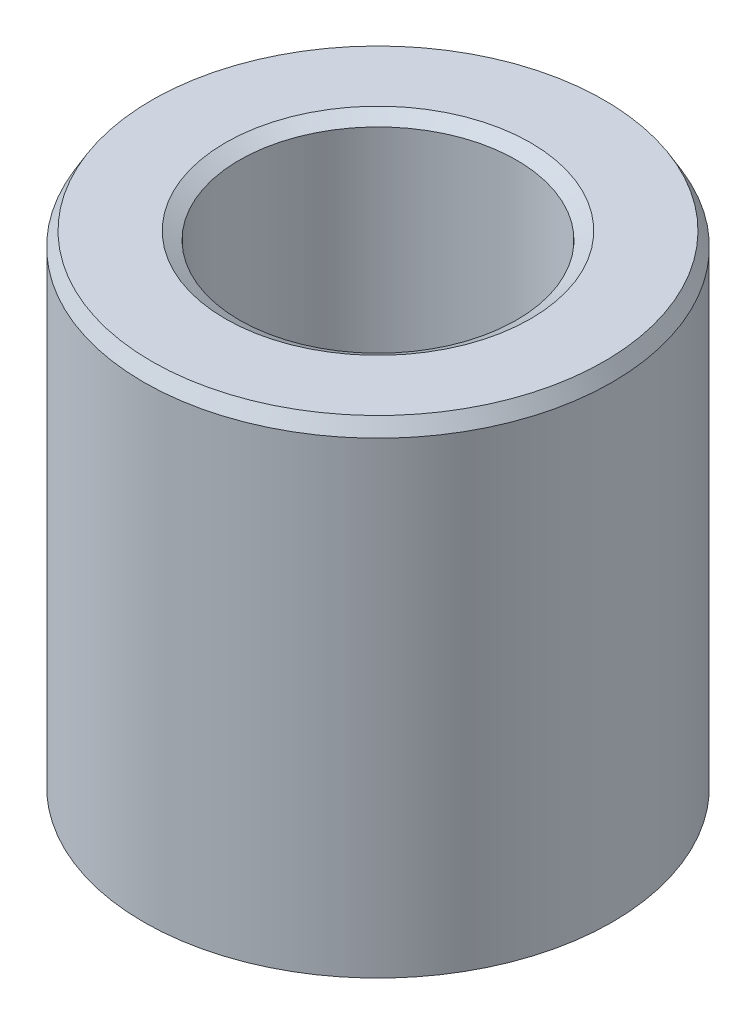
ISO-10303-21;
HEADER;
FILE_DESCRIPTION(('STEP AP214'),'2;1');
FILE_NAME('part.step','',(''),(''),'','','');
FILE_SCHEMA(('AUTOMOTIVE_DESIGN { 1 0 10303 214 1 1 1 1 }'));
ENDSEC;
DATA;
#1=APPLICATION_CONTEXT('core data for automotive mechanical design processes');
#2=APPLICATION_PROTOCOL_DEFINITION('international standard','automotive_design',2000,#1);
#3=PRODUCT_CONTEXT('',#1,'mechanical');
#4=PRODUCT('Part','Part','',(#3));
#5=PRODUCT_RELATED_PRODUCT_CATEGORY('part','',(#4));
#6=PRODUCT_DEFINITION_FORMATION('','',#4);
#7=PRODUCT_DEFINITION_CONTEXT('part definition',#1,'design');
#8=PRODUCT_DEFINITION('design','',#6,#7);
#9=PRODUCT_DEFINITION_SHAPE('','',#8);
#10=(LENGTH_UNIT() NAMED_UNIT(*) SI_UNIT(.MILLI.,.METRE.));
#11=(NAMED_UNIT(*) PLANE_ANGLE_UNIT() SI_UNIT($,.RADIAN.));
#12=(NAMED_UNIT(*) SI_UNIT($,.STERADIAN.) SOLID_ANGLE_UNIT());
#13=UNCERTAINTY_MEASURE_WITH_UNIT(LENGTH_MEASURE(1.E-05),#10,'distance_accuracy_value','');
#14=(GEOMETRIC_REPRESENTATION_CONTEXT(3) GLOBAL_UNCERTAINTY_ASSIGNED_CONTEXT((#13)) GLOBAL_UNIT_ASSIGNED_CONTEXT((#10,
#11,#12)) REPRESENTATION_CONTEXT('',''));
#15=CARTESIAN_POINT('',(0.,0.,0.));
#16=DIRECTION('',(0.,0.,1.));
#17=DIRECTION('',(1.,0.,0.));
#18=AXIS2_PLACEMENT_3D('',#15,#16,#17);
#19=CARTESIAN_POINT('',(0.,20.8910306341765,0.));
#20=DIRECTION('',(0.,-1.,0.));
#21=DIRECTION('',(0.,0.,-1.));
#22=AXIS2_PLACEMENT_3D('',#19,#20,#21);
#23=CYLINDRICAL_SURFACE('',#22,10.);
#24=CARTESIAN_POINT('',(0.,0.344347625462153,0.));
#25=DIRECTION('',(0.,1.,0.));
#26=DIRECTION('',(0.,0.,1.));
#27=AXIS2_PLACEMENT_3D('',#24,#25,#26);
#28=CIRCLE('',#27,10.);
#29=CARTESIAN_POINT('',(0.,0.344347625462153,10.));
#30=VERTEX_POINT('',#29);
#31=EDGE_CURVE('E10',#30,#30,#28,.T.);
#32=ORIENTED_EDGE('',*,*,#31,.T.);
#33=EDGE_LOOP('',(#32));
#34=FACE_BOUND('',#33,.T.);
#35=CARTESIAN_POINT('',(0.,20.2946030514103,0.));
#36=DIRECTION('',(0.,1.,0.));
#37=DIRECTION('',(0.,0.,1.));
#38=AXIS2_PLACEMENT_3D('',#35,#36,#37);
#39=CIRCLE('',#38,10.);
#40=CARTESIAN_POINT('',(0.,20.2946030514103,10.));
#41=VERTEX_POINT('',#40);
#42=EDGE_CURVE('E50',#41,#41,#39,.F.);
#43=ORIENTED_EDGE('',*,*,#42,.T.);
#44=EDGE_LOOP('',(#43));
#45=FACE_BOUND('',#44,.T.);
#46=ADVANCED_FACE('F39',(#34,#45),#23,.T.);
#47=CARTESIAN_POINT('',(0.,20.8910306341765,0.));
#48=DIRECTION('',(0.,1.,0.));
#49=DIRECTION('',(0.,0.,1.));
#50=AXIS2_PLACEMENT_3D('',#47,#48,#49);
#51=PLANE('',#50);
#52=CARTESIAN_POINT('',(0.,20.8910306341765,0.));
#53=DIRECTION('',(0.,1.,0.));
#54=DIRECTION('',(0.,0.,1.));
#55=AXIS2_PLACEMENT_3D('',#52,#53,#54);
#56=CIRCLE('',#55,6.51067474458008);
#57=CARTESIAN_POINT('',(0.,20.8910306341765,6.51067474458008));
#58=VERTEX_POINT('',#57);
#59=EDGE_CURVE('E58',#58,#58,#56,.F.);
#60=ORIENTED_EDGE('',*,*,#59,.T.);
#61=EDGE_LOOP('',(#60));
#62=FACE_BOUND('',#61,.T.);
#63=CARTESIAN_POINT('',(0.,20.8910306341765,0.));
#64=DIRECTION('',(0.,1.,0.));
#65=DIRECTION('',(0.,0.,1.));
#66=AXIS2_PLACEMENT_3D('',#63,#64,#65);
#67=CIRCLE('',#66,9.65565237453785);
#68=CARTESIAN_POINT('',(0.,20.8910306341765,9.65565237453785));
#69=VERTEX_POINT('',#68);
#70=EDGE_CURVE('E61',#69,#69,#67,.T.);
#71=ORIENTED_EDGE('',*,*,#70,.T.);
#72=EDGE_LOOP('',(#71));
#73=FACE_BOUND('',#72,.T.);
#74=ADVANCED_FACE('F88',(#62,#73),#51,.T.);
#75=CARTESIAN_POINT('',(0.,0.,0.));
#76=DIRECTION('',(0.,1.,0.));
#77=DIRECTION('',(0.,0.,1.));
#78=AXIS2_PLACEMENT_3D('',#75,#76,#77);
#79=PLANE('',#78);
#80=CARTESIAN_POINT('',(0.,0.,0.));
#81=DIRECTION('',(0.,1.,0.));
#82=DIRECTION('',(0.,0.,1.));
#83=AXIS2_PLACEMENT_3D('',#80,#81,#82);
#84=CIRCLE('',#83,6.25859478727609);
#85=CARTESIAN_POINT('',(0.,0.,6.25859478727609));
#86=VERTEX_POINT('',#85);
#87=EDGE_CURVE('E51',#86,#86,#84,.T.);
#88=ORIENTED_EDGE('',*,*,#87,.T.);
#89=EDGE_LOOP('',(#88));
#90=FACE_BOUND('',#89,.T.);
#91=CARTESIAN_POINT('',(0.,0.,0.));
#92=DIRECTION('',(0.,1.,0.));
#93=DIRECTION('',(0.,0.,1.));
#94=AXIS2_PLACEMENT_3D('',#91,#92,#93);
#95=CIRCLE('',#94,9.40357241723385);
#96=CARTESIAN_POINT('',(0.,0.,9.40357241723385));
#97=VERTEX_POINT('',#96);
#98=EDGE_CURVE('E54',#97,#97,#95,.F.);
#99=ORIENTED_EDGE('',*,*,#98,.T.);
#100=EDGE_LOOP('',(#99));
#101=FACE_BOUND('',#100,.T.);
#102=ADVANCED_FACE('F83',(#90,#101),#79,.F.);
#103=CARTESIAN_POINT('',(0.,20.8910306341765,0.));
#104=DIRECTION('',(0.,-1.,0.));
#105=DIRECTION('',(0.,0.,-1.));
#106=AXIS2_PLACEMENT_3D('',#103,#104,#105);
#107=CYLINDRICAL_SURFACE('',#106,5.91424716181393);
#108=CARTESIAN_POINT('',(0.,20.5466830087143,0.));
#109=DIRECTION('',(0.,1.,0.));
#110=DIRECTION('',(0.,0.,1.));
#111=AXIS2_PLACEMENT_3D('',#108,#109,#110);
#112=CIRCLE('',#111,5.91424716181393);
#113=CARTESIAN_POINT('',(0.,20.5466830087143,5.91424716181393));
#114=VERTEX_POINT('',#113);
#115=EDGE_CURVE('E67',#114,#114,#112,.T.);
#116=ORIENTED_EDGE('',*,*,#115,.T.);
#117=EDGE_LOOP('',(#116));
#118=FACE_BOUND('',#117,.T.);
#119=CARTESIAN_POINT('',(0.,0.596427582766155,0.));
#120=DIRECTION('',(0.,1.,0.));
#121=DIRECTION('',(0.,0.,1.));
#122=AXIS2_PLACEMENT_3D('',#119,#120,#121);
#123=CIRCLE('',#122,5.91424716181393);
#124=CARTESIAN_POINT('',(0.,0.596427582766155,5.91424716181393));
#125=VERTEX_POINT('',#124);
#126=EDGE_CURVE('E69',#125,#125,#123,.F.);
#127=ORIENTED_EDGE('',*,*,#126,.T.);
#128=EDGE_LOOP('',(#127));
#129=FACE_BOUND('',#128,.T.);
#130=ADVANCED_FACE('F71',(#118,#129),#107,.F.);
#131=CARTESIAN_POINT('',(0.,20.5466830087143,0.));
#132=DIRECTION('',(0.,1.,0.));
#133=DIRECTION('',(0.,0.,1.));
#134=AXIS2_PLACEMENT_3D('',#131,#132,#133);
#135=CONICAL_SURFACE('',#134,5.91424716181393,1.0471975511966);
#136=CARTESIAN_POINT('',(0.,20.8910306341765,6.51067474458008));
#137=CARTESIAN_POINT('',(0.,20.8874436797446,6.5044619572596));
#138=CARTESIAN_POINT('',(0.,20.8838567253127,6.49824916993912));
#139=CARTESIAN_POINT('',(0.,20.8766828164489,6.48582359529815));
#140=CARTESIAN_POINT('',(0.,20.873095862017,6.47961080797767));
#141=CARTESIAN_POINT('',(0.,20.8659219531532,6.46718523333671));
#142=CARTESIAN_POINT('',(0.,20.8623349987213,6.46097244601623));
#143=CARTESIAN_POINT('',(0.,20.8551610898575,6.44854687137527));
#144=CARTESIAN_POINT('',(0.,20.8515741354256,6.44233408405479));
#145=CARTESIAN_POINT('',(0.,20.8444002265618,6.42990850941383));
#146=CARTESIAN_POINT('',(0.,20.8408132721299,6.42369572209335));
#147=CARTESIAN_POINT('',(0.,20.8336393632661,6.41127014745238));
#148=CARTESIAN_POINT('',(0.,20.8300524088342,6.4050573601319));
#149=CARTESIAN_POINT('',(0.,20.8228784999704,6.39263178549094));
#150=CARTESIAN_POINT('',(0.,20.8192915455385,6.38641899817046));
#151=CARTESIAN_POINT('',(0.,20.8121176366747,6.3739934235295));
#152=CARTESIAN_POINT('',(0.,20.8085306822428,6.36778063620902));
#153=CARTESIAN_POINT('',(0.,20.8013567733791,6.35535506156806));
#154=CARTESIAN_POINT('',(0.,20.7977698189472,6.34914227424758));
#155=CARTESIAN_POINT('',(0.,20.7905959100834,6.33671669960662));
#156=CARTESIAN_POINT('',(0.,20.7870089556515,6.33050391228613));
#157=CARTESIAN_POINT('',(0.,20.7798350467877,6.31807833764517));
#158=CARTESIAN_POINT('',(0.,20.7762480923558,6.31186555032469));
#159=CARTESIAN_POINT('',(0.,20.769074183492,6.29943997568373));
#160=CARTESIAN_POINT('',(0.,20.7654872290601,6.29322718836325));
#161=CARTESIAN_POINT('',(0.,20.7583133201963,6.28080161372229));
#162=CARTESIAN_POINT('',(0.,20.7547263657644,6.27458882640181));
#163=CARTESIAN_POINT('',(0.,20.7475524569006,6.26216325176085));
#164=CARTESIAN_POINT('',(0.,20.7439655024687,6.25595046444037));
#165=CARTESIAN_POINT('',(0.,20.7367915936049,6.2435248897994));
#166=CARTESIAN_POINT('',(0.,20.733204639173,6.23731210247892));
#167=CARTESIAN_POINT('',(0.,20.7260307303092,6.22488652783796));
#168=CARTESIAN_POINT('',(0.,20.7224437758773,6.21867374051748));
#169=CARTESIAN_POINT('',(0.,20.7152698670135,6.20624816587652));
#170=CARTESIAN_POINT('',(0.,20.7116829125816,6.20003537855604));
#171=CARTESIAN_POINT('',(0.,20.7045090037178,6.18760980391508));
#172=CARTESIAN_POINT('',(0.,20.7009220492859,6.1813970165946));
#173=CARTESIAN_POINT('',(0.,20.6937481404221,6.16897144195364));
#174=CARTESIAN_POINT('',(0.,20.6901611859902,6.16275865463315));
#175=CARTESIAN_POINT('',(0.,20.6829872771264,6.15033307999219));
#176=CARTESIAN_POINT('',(0.,20.6794003226945,6.14412029267171));
#177=CARTESIAN_POINT('',(0.,20.6722264138307,6.13169471803075));
#178=CARTESIAN_POINT('',(0.,20.6686394593989,6.12548193071027));
#179=CARTESIAN_POINT('',(0.,20.6614655505351,6.11305635606931));
#180=CARTESIAN_POINT('',(0.,20.6578785961032,6.10684356874883));
#181=CARTESIAN_POINT('',(0.,20.6507046872394,6.09441799410787));
#182=CARTESIAN_POINT('',(0.,20.6471177328075,6.08820520678739));
#183=CARTESIAN_POINT('',(0.,20.6399438239437,6.07577963214642));
#184=CARTESIAN_POINT('',(0.,20.6363568695118,6.06956684482594));
#185=CARTESIAN_POINT('',(0.,20.629182960648,6.05714127018498));
#186=CARTESIAN_POINT('',(0.,20.6255960062161,6.0509284828645));
#187=CARTESIAN_POINT('',(0.,20.6184220973523,6.03850290822354));
#188=CARTESIAN_POINT('',(0.,20.6148351429204,6.03229012090306));
#189=CARTESIAN_POINT('',(0.,20.6076612340566,6.0198645462621));
#190=CARTESIAN_POINT('',(0.,20.6040742796247,6.01365175894162));
#191=CARTESIAN_POINT('',(0.,20.5969003707609,6.00122618430066));
#192=CARTESIAN_POINT('',(0.,20.593313416329,5.99501339698018));
#193=CARTESIAN_POINT('',(0.,20.5861395074652,5.98258782233921));
#194=CARTESIAN_POINT('',(0.,20.5825525530333,5.97637503501873));
#195=CARTESIAN_POINT('',(0.,20.5753786441695,5.96394946037777));
#196=CARTESIAN_POINT('',(0.,20.5717916897376,5.95773667305729));
#197=CARTESIAN_POINT('',(0.,20.5646177808738,5.94531109841633));
#198=CARTESIAN_POINT('',(0.,20.5610308264419,5.93909831109585));
#199=CARTESIAN_POINT('',(0.,20.5538569175781,5.92667273645489));
#200=CARTESIAN_POINT('',(0.,20.5502699631462,5.92045994913441));
#201=CARTESIAN_POINT('',(0.,20.5466830087143,5.91424716181393));
#202=B_SPLINE_CURVE_WITH_KNOTS('',3,(#136,#137,#138,#139,#140,#141,#142,#143,#144,#145,#146,
#147,#148,#149,#150,#151,#152,#153,#154,#155,#156,#157,#158,#159,#160,#161,#162,#163,#164,#165,
#166,#167,#168,#169,#170,#171,#172,#173,#174,#175,#176,#177,#178,#179,#180,#181,#182,#183,#184,
#185,#186,#187,#188,#189,#190,#191,#192,#193,#194,#195,#196,#197,#198,#199,#200,#201),
.UNSPECIFIED.,.F.,.F.,(4,2,2,2,2,2,2,2,2,2,2,2,2,2,2,2,2,2,2,2,2,2,2,2,2,2,2,2,2,2,2,2,4),(0.,
0.0215217265913855,0.0430434531827692,0.0645651797741547,0.0860869063655384,0.107608632956924,
0.129130359548308,0.150652086139693,0.172173812731077,0.193695539322462,0.215217265913846,
0.236738992505232,0.258260719096615,0.279782445688001,0.301304172279385,0.32282589887077,
0.344347625462154,0.365869352053539,0.387391078644923,0.408912805236308,0.430434531827692,
0.451956258419078,0.473477985010461,0.494999711601847,0.516521438193232,0.538043164784616,
0.559564891376002,0.581086617967385,0.602608344558771,0.624130071150155,0.64565179774154,
0.667173524332923,0.688695250924307),.UNSPECIFIED.);
#203=EDGE_CURVE('BSEAM77',#58,#114,#202,.T.);
#204=ORIENTED_EDGE('',*,*,#59,.F.);
#205=ORIENTED_EDGE('',*,*,#115,.F.);
#206=ORIENTED_EDGE('',*,*,#203,.T.);
#207=ORIENTED_EDGE('',*,*,#203,.F.);
#208=EDGE_LOOP('',(#204,#206,#205,#207));
#209=FACE_BOUND('',#208,.T.);
#210=ADVANCED_FACE('F77',(#209),#135,.F.);
#211=CARTESIAN_POINT('',(0.,0.,0.));
#212=DIRECTION('',(0.,-1.,0.));
#213=DIRECTION('',(0.,0.,-1.));
#214=AXIS2_PLACEMENT_3D('',#211,#212,#213);
#215=CONICAL_SURFACE('',#214,6.25859478727609,0.523598775598298);
#216=ORIENTED_EDGE('',*,*,#126,.F.);
#217=EDGE_LOOP('',(#216));
#218=FACE_BOUND('',#217,.T.);
#219=ORIENTED_EDGE('',*,*,#87,.F.);
#220=EDGE_LOOP('',(#219));
#221=FACE_BOUND('',#220,.T.);
#222=ADVANCED_FACE('F73',(#218,#221),#215,.F.);
#223=CARTESIAN_POINT('',(0.,0.344347625462153,0.));
#224=DIRECTION('',(0.,1.,0.));
#225=DIRECTION('',(0.,0.,1.));
#226=AXIS2_PLACEMENT_3D('',#223,#224,#225);
#227=CONICAL_SURFACE('',#226,10.,1.0471975511966);
#228=ORIENTED_EDGE('',*,*,#98,.F.);
#229=EDGE_LOOP('',(#228));
#230=FACE_BOUND('',#229,.T.);
#231=ORIENTED_EDGE('',*,*,#31,.F.);
#232=EDGE_LOOP('',(#231));
#233=FACE_BOUND('',#232,.T.);
#234=ADVANCED_FACE('F76',(#230,#233),#227,.T.);
#235=CARTESIAN_POINT('',(0.,20.8910306341765,0.));
#236=DIRECTION('',(0.,-1.,0.));
#237=DIRECTION('',(0.,0.,-1.));
#238=AXIS2_PLACEMENT_3D('',#235,#236,#237);
#239=CONICAL_SURFACE('',#238,9.65565237453785,0.523598775598292);
#240=ORIENTED_EDGE('',*,*,#42,.F.);
#241=EDGE_LOOP('',(#240));
#242=FACE_BOUND('',#241,.T.);
#243=ORIENTED_EDGE('',*,*,#70,.F.);
#244=EDGE_LOOP('',(#243));
#245=FACE_BOUND('',#244,.T.);
#246=ADVANCED_FACE('F45',(#242,#245),#239,.T.);
#247=CLOSED_SHELL('',(#46,#74,#102,#130,#210,#222,#234,#246));
#248=MANIFOLD_SOLID_BREP('B2',#247);
#249=ADVANCED_BREP_SHAPE_REPRESENTATION('',(#18,#248),#14);
#250=SHAPE_DEFINITION_REPRESENTATION(#9,#249);
ENDSEC;
END-ISO-10303-21;
